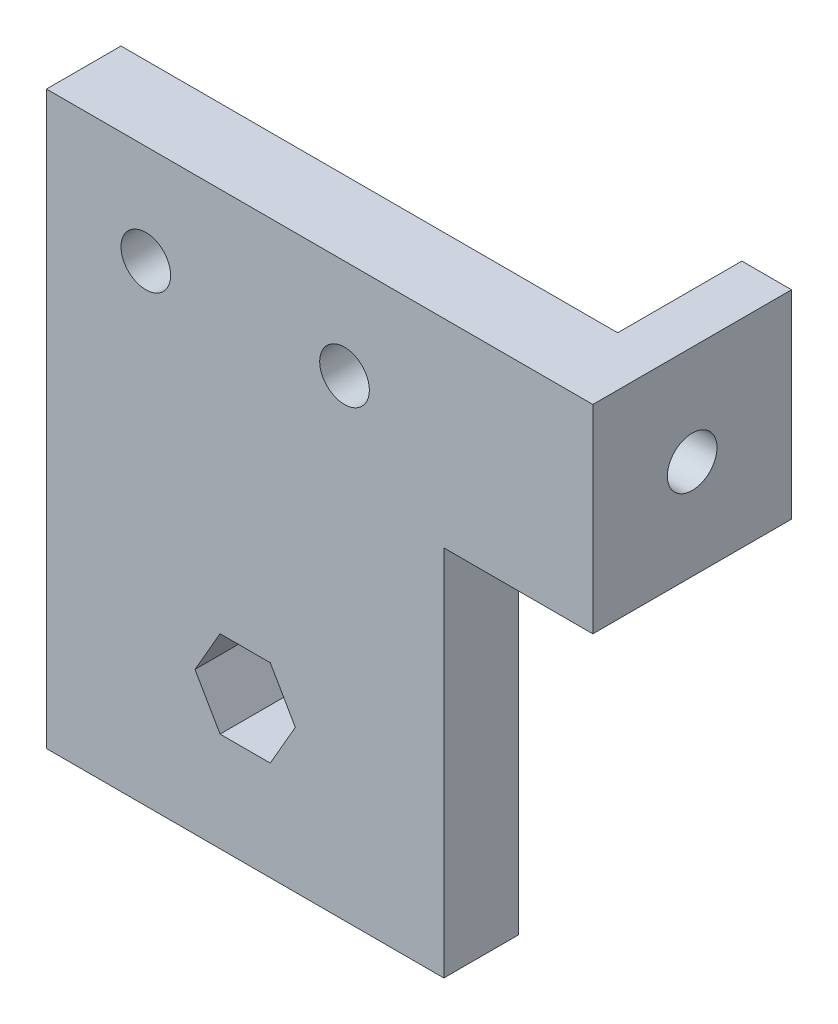
ISO-10303-21;
HEADER;
FILE_DESCRIPTION(('STEP AP214'),'2;1');
FILE_NAME('part.step','',(''),(''),'','','');
FILE_SCHEMA(('AUTOMOTIVE_DESIGN { 1 0 10303 214 1 1 1 1 }'));
ENDSEC;
DATA;
#1=APPLICATION_CONTEXT('core data for automotive mechanical design processes');
#2=APPLICATION_PROTOCOL_DEFINITION('international standard','automotive_design',2000,#1);
#3=PRODUCT_CONTEXT('',#1,'mechanical');
#4=PRODUCT('Part','Part','',(#3));
#5=PRODUCT_RELATED_PRODUCT_CATEGORY('part','',(#4));
#6=PRODUCT_DEFINITION_FORMATION('','',#4);
#7=PRODUCT_DEFINITION_CONTEXT('part definition',#1,'design');
#8=PRODUCT_DEFINITION('design','',#6,#7);
#9=PRODUCT_DEFINITION_SHAPE('','',#8);
#10=(LENGTH_UNIT() NAMED_UNIT(*) SI_UNIT(.MILLI.,.METRE.));
#11=(NAMED_UNIT(*) PLANE_ANGLE_UNIT() SI_UNIT($,.RADIAN.));
#12=(NAMED_UNIT(*) SI_UNIT($,.STERADIAN.) SOLID_ANGLE_UNIT());
#13=UNCERTAINTY_MEASURE_WITH_UNIT(LENGTH_MEASURE(1.E-05),#10,'distance_accuracy_value','');
#14=(GEOMETRIC_REPRESENTATION_CONTEXT(3) GLOBAL_UNCERTAINTY_ASSIGNED_CONTEXT((#13)) GLOBAL_UNIT_ASSIGNED_CONTEXT((#10,
#11,#12)) REPRESENTATION_CONTEXT('',''));
#15=CARTESIAN_POINT('',(0.,0.,0.));
#16=DIRECTION('',(0.,0.,1.));
#17=DIRECTION('',(1.,0.,0.));
#18=AXIS2_PLACEMENT_3D('',#15,#16,#17);
#19=CARTESIAN_POINT('',(0.,73.025,0.));
#20=DIRECTION('',(0.,0.,-1.));
#21=DIRECTION('',(-1.,0.,0.));
#22=AXIS2_PLACEMENT_3D('',#19,#20,#21);
#23=PLANE('',#22);
#24=DIRECTION('',(1.,0.,0.));
#25=VECTOR('',#24,1.);
#26=CARTESIAN_POINT('',(22.1920975668151,12.7,0.));
#27=LINE('',#26,#25);
#28=CARTESIAN_POINT('',(22.1920975668151,12.7,0.));
#29=VERTEX_POINT('',#28);
#30=CARTESIAN_POINT('',(28.6079024331849,12.7,0.));
#31=VERTEX_POINT('',#30);
#32=EDGE_CURVE('E250',#29,#31,#27,.T.);
#33=ORIENTED_EDGE('',*,*,#32,.T.);
#34=DIRECTION('',(0.5,0.866025403784439,0.));
#35=VECTOR('',#34,1.);
#36=CARTESIAN_POINT('',(28.6079024331849,12.7,0.));
#37=LINE('',#36,#35);
#38=CARTESIAN_POINT('',(31.8158048663697,18.25625,0.));
#39=VERTEX_POINT('',#38);
#40=EDGE_CURVE('E266',#31,#39,#37,.T.);
#41=ORIENTED_EDGE('',*,*,#40,.T.);
#42=DIRECTION('',(-0.5,0.866025403784439,0.));
#43=VECTOR('',#42,1.);
#44=CARTESIAN_POINT('',(31.8158048663697,18.25625,0.));
#45=LINE('',#44,#43);
#46=CARTESIAN_POINT('',(28.6079024331849,23.8125,0.));
#47=VERTEX_POINT('',#46);
#48=EDGE_CURVE('E263',#39,#47,#45,.T.);
#49=ORIENTED_EDGE('',*,*,#48,.T.);
#50=DIRECTION('',(-1.,0.,0.));
#51=VECTOR('',#50,1.);
#52=CARTESIAN_POINT('',(28.6079024331849,23.8125,0.));
#53=LINE('',#52,#51);
#54=CARTESIAN_POINT('',(22.1920975668151,23.8125,0.));
#55=VERTEX_POINT('',#54);
#56=EDGE_CURVE('E260',#47,#55,#53,.T.);
#57=ORIENTED_EDGE('',*,*,#56,.T.);
#58=DIRECTION('',(-0.5,-0.866025403784439,0.));
#59=VECTOR('',#58,1.);
#60=CARTESIAN_POINT('',(22.1920975668151,23.8125,0.));
#61=LINE('',#60,#59);
#62=CARTESIAN_POINT('',(18.9841951336303,18.25625,0.));
#63=VERTEX_POINT('',#62);
#64=EDGE_CURVE('E257',#55,#63,#61,.T.);
#65=ORIENTED_EDGE('',*,*,#64,.T.);
#66=DIRECTION('',(0.5,-0.866025403784439,0.));
#67=VECTOR('',#66,1.);
#68=CARTESIAN_POINT('',(18.9841951336303,18.25625,0.));
#69=LINE('',#68,#67);
#70=EDGE_CURVE('E254',#63,#29,#69,.T.);
#71=ORIENTED_EDGE('',*,*,#70,.T.);
#72=EDGE_LOOP('',(#33,#41,#49,#57,#65,#71));
#73=FACE_BOUND('',#72,.T.);
#74=CARTESIAN_POINT('',(12.7,60.325,0.));
#75=DIRECTION('',(0.,0.,1.));
#76=DIRECTION('',(1.,0.,0.));
#77=AXIS2_PLACEMENT_3D('',#74,#75,#76);
#78=CIRCLE('',#77,3.175);
#79=CARTESIAN_POINT('',(15.875,60.325,0.));
#80=VERTEX_POINT('',#79);
#81=EDGE_CURVE('E224',#80,#80,#78,.T.);
#82=ORIENTED_EDGE('',*,*,#81,.T.);
#83=EDGE_LOOP('',(#82));
#84=FACE_BOUND('',#83,.T.);
#85=CARTESIAN_POINT('',(38.1,60.325,0.));
#86=DIRECTION('',(0.,0.,1.));
#87=DIRECTION('',(-1.,0.,0.));
#88=AXIS2_PLACEMENT_3D('',#85,#86,#87);
#89=CIRCLE('',#88,3.175);
#90=CARTESIAN_POINT('',(34.925,60.325,0.));
#91=VERTEX_POINT('',#90);
#92=EDGE_CURVE('E230',#91,#91,#89,.T.);
#93=ORIENTED_EDGE('',*,*,#92,.T.);
#94=EDGE_LOOP('',(#93));
#95=FACE_BOUND('',#94,.T.);
#96=DIRECTION('',(1.,0.,0.));
#97=VECTOR('',#96,1.);
#98=CARTESIAN_POINT('',(50.8,64.452011509555,0.));
#99=LINE('',#98,#97);
#100=CARTESIAN_POINT('',(63.5,64.452011509555,0.));
#101=VERTEX_POINT('',#100);
#102=CARTESIAN_POINT('',(48.8,64.452011509555,0.));
#103=VERTEX_POINT('',#102);
#104=EDGE_CURVE('E52',#101,#103,#99,.F.);
#105=ORIENTED_EDGE('',*,*,#104,.T.);
#106=DIRECTION('',(0.,1.,0.));
#107=VECTOR('',#106,1.);
#108=CARTESIAN_POINT('',(48.8,56.1979884904449,0.));
#109=LINE('',#108,#107);
#110=CARTESIAN_POINT('',(48.8,56.1979884904449,0.));
#111=VERTEX_POINT('',#110);
#112=EDGE_CURVE('E164',#103,#111,#109,.F.);
#113=ORIENTED_EDGE('',*,*,#112,.T.);
#114=DIRECTION('',(1.,0.,0.));
#115=VECTOR('',#114,1.);
#116=CARTESIAN_POINT('',(50.8,56.1979884904449,0.));
#117=LINE('',#116,#115);
#118=CARTESIAN_POINT('',(63.5,56.1979884904449,0.));
#119=VERTEX_POINT('',#118);
#120=EDGE_CURVE('E59',#111,#119,#117,.T.);
#121=ORIENTED_EDGE('',*,*,#120,.T.);
#122=DIRECTION('',(0.,1.,0.));
#123=VECTOR('',#122,1.);
#124=CARTESIAN_POINT('',(63.5,73.025,0.));
#125=LINE('',#124,#123);
#126=CARTESIAN_POINT('',(63.5,47.625,0.));
#127=VERTEX_POINT('',#126);
#128=EDGE_CURVE('E161',#127,#119,#125,.T.);
#129=ORIENTED_EDGE('',*,*,#128,.F.);
#130=DIRECTION('',(1.,0.,0.));
#131=VECTOR('',#130,1.);
#132=CARTESIAN_POINT('',(50.8,47.625,0.));
#133=LINE('',#132,#131);
#134=CARTESIAN_POINT('',(50.8,47.625,0.));
#135=VERTEX_POINT('',#134);
#136=EDGE_CURVE('E175',#135,#127,#133,.T.);
#137=ORIENTED_EDGE('',*,*,#136,.F.);
#138=DIRECTION('',(0.,1.,0.));
#139=VECTOR('',#138,1.);
#140=CARTESIAN_POINT('',(50.8,0.,0.));
#141=LINE('',#140,#139);
#142=CARTESIAN_POINT('',(50.8,0.,0.));
#143=VERTEX_POINT('',#142);
#144=EDGE_CURVE('E185',#143,#135,#141,.T.);
#145=ORIENTED_EDGE('',*,*,#144,.F.);
#146=DIRECTION('',(1.,0.,0.));
#147=VECTOR('',#146,1.);
#148=CARTESIAN_POINT('',(0.,0.,0.));
#149=LINE('',#148,#147);
#150=CARTESIAN_POINT('',(0.,0.,0.));
#151=VERTEX_POINT('',#150);
#152=EDGE_CURVE('E204',#151,#143,#149,.T.);
#153=ORIENTED_EDGE('',*,*,#152,.F.);
#154=DIRECTION('',(0.,-1.,0.));
#155=VECTOR('',#154,1.);
#156=CARTESIAN_POINT('',(0.,0.,0.));
#157=LINE('',#156,#155);
#158=CARTESIAN_POINT('',(0.,73.025,0.));
#159=VERTEX_POINT('',#158);
#160=EDGE_CURVE('E208',#159,#151,#157,.T.);
#161=ORIENTED_EDGE('',*,*,#160,.F.);
#162=DIRECTION('',(-1.,0.,0.));
#163=VECTOR('',#162,1.);
#164=CARTESIAN_POINT('',(0.,73.025,0.));
#165=LINE('',#164,#163);
#166=CARTESIAN_POINT('',(63.5,73.025,0.));
#167=VERTEX_POINT('',#166);
#168=EDGE_CURVE('E170',#167,#159,#165,.T.);
#169=ORIENTED_EDGE('',*,*,#168,.F.);
#170=EDGE_CURVE('E171',#101,#167,#125,.T.);
#171=ORIENTED_EDGE('',*,*,#170,.F.);
#172=EDGE_LOOP('',(#105,#113,#121,#129,#137,#145,#153,#161,#169,#171));
#173=FACE_BOUND('',#172,.T.);
#174=ADVANCED_FACE('F32',(#73,#84,#95,#173),#23,.T.);
#175=CARTESIAN_POINT('',(0.,73.025,9.525));
#176=DIRECTION('',(0.,0.,-1.));
#177=DIRECTION('',(-1.,0.,0.));
#178=AXIS2_PLACEMENT_3D('',#175,#176,#177);
#179=PLANE('',#178);
#180=CARTESIAN_POINT('',(38.1,60.325,9.525));
#181=DIRECTION('',(0.,0.,1.));
#182=DIRECTION('',(-1.,0.,0.));
#183=AXIS2_PLACEMENT_3D('',#180,#181,#182);
#184=CIRCLE('',#183,3.175);
#185=CARTESIAN_POINT('',(34.925,60.325,9.525));
#186=VERTEX_POINT('',#185);
#187=EDGE_CURVE('E227',#186,#186,#184,.T.);
#188=ORIENTED_EDGE('',*,*,#187,.F.);
#189=EDGE_LOOP('',(#188));
#190=FACE_BOUND('',#189,.T.);
#191=DIRECTION('',(0.,-1.,0.));
#192=VECTOR('',#191,1.);
#193=CARTESIAN_POINT('',(0.,0.,9.525));
#194=LINE('',#193,#192);
#195=CARTESIAN_POINT('',(0.,73.025,9.525));
#196=VERTEX_POINT('',#195);
#197=CARTESIAN_POINT('',(0.,0.,9.525));
#198=VERTEX_POINT('',#197);
#199=EDGE_CURVE('E173',#196,#198,#194,.T.);
#200=ORIENTED_EDGE('',*,*,#199,.T.);
#201=DIRECTION('',(1.,0.,0.));
#202=VECTOR('',#201,1.);
#203=CARTESIAN_POINT('',(0.,0.,9.525));
#204=LINE('',#203,#202);
#205=CARTESIAN_POINT('',(50.8,0.,9.525));
#206=VERTEX_POINT('',#205);
#207=EDGE_CURVE('E220',#198,#206,#204,.T.);
#208=ORIENTED_EDGE('',*,*,#207,.T.);
#209=DIRECTION('',(0.,1.,0.));
#210=VECTOR('',#209,1.);
#211=CARTESIAN_POINT('',(50.8,0.,9.525));
#212=LINE('',#211,#210);
#213=CARTESIAN_POINT('',(50.8,47.625,9.525));
#214=VERTEX_POINT('',#213);
#215=EDGE_CURVE('E218',#206,#214,#212,.T.);
#216=ORIENTED_EDGE('',*,*,#215,.T.);
#217=DIRECTION('',(1.,0.,0.));
#218=VECTOR('',#217,1.);
#219=CARTESIAN_POINT('',(50.8,47.625,9.525));
#220=LINE('',#219,#218);
#221=CARTESIAN_POINT('',(69.85,47.625,9.525));
#222=VERTEX_POINT('',#221);
#223=EDGE_CURVE('E216',#214,#222,#220,.T.);
#224=ORIENTED_EDGE('',*,*,#223,.T.);
#225=DIRECTION('',(0.,-1.,0.));
#226=VECTOR('',#225,1.);
#227=CARTESIAN_POINT('',(69.85,73.025,9.525));
#228=LINE('',#227,#226);
#229=CARTESIAN_POINT('',(69.85,73.025,9.525));
#230=VERTEX_POINT('',#229);
#231=EDGE_CURVE('E309',#230,#222,#228,.T.);
#232=ORIENTED_EDGE('',*,*,#231,.F.);
#233=DIRECTION('',(-1.,0.,0.));
#234=VECTOR('',#233,1.);
#235=CARTESIAN_POINT('',(50.8,73.025,9.525));
#236=LINE('',#235,#234);
#237=EDGE_CURVE('E192',#230,#196,#236,.T.);
#238=ORIENTED_EDGE('',*,*,#237,.T.);
#239=EDGE_LOOP('',(#200,#208,#216,#224,#232,#238));
#240=FACE_BOUND('',#239,.T.);
#241=CARTESIAN_POINT('',(12.7,60.325,9.525));
#242=DIRECTION('',(0.,0.,1.));
#243=DIRECTION('',(1.,0.,0.));
#244=AXIS2_PLACEMENT_3D('',#241,#242,#243);
#245=CIRCLE('',#244,3.175);
#246=CARTESIAN_POINT('',(15.875,60.325,9.525));
#247=VERTEX_POINT('',#246);
#248=EDGE_CURVE('E212',#247,#247,#245,.T.);
#249=ORIENTED_EDGE('',*,*,#248,.F.);
#250=EDGE_LOOP('',(#249));
#251=FACE_BOUND('',#250,.T.);
#252=DIRECTION('',(0.5,0.866025403784439,0.));
#253=VECTOR('',#252,1.);
#254=CARTESIAN_POINT('',(28.6079024331849,12.7,9.525));
#255=LINE('',#254,#253);
#256=CARTESIAN_POINT('',(28.6079024331849,12.7,9.525));
#257=VERTEX_POINT('',#256);
#258=CARTESIAN_POINT('',(31.8158048663697,18.25625,9.525));
#259=VERTEX_POINT('',#258);
#260=EDGE_CURVE('E253',#257,#259,#255,.T.);
#261=ORIENTED_EDGE('',*,*,#260,.F.);
#262=DIRECTION('',(1.,0.,0.));
#263=VECTOR('',#262,1.);
#264=CARTESIAN_POINT('',(22.1920975668151,12.7,9.525));
#265=LINE('',#264,#263);
#266=CARTESIAN_POINT('',(22.1920975668151,12.7,9.525));
#267=VERTEX_POINT('',#266);
#268=EDGE_CURVE('E249',#267,#257,#265,.T.);
#269=ORIENTED_EDGE('',*,*,#268,.F.);
#270=DIRECTION('',(0.5,-0.866025403784439,0.));
#271=VECTOR('',#270,1.);
#272=CARTESIAN_POINT('',(18.9841951336303,18.25625,9.525));
#273=LINE('',#272,#271);
#274=CARTESIAN_POINT('',(18.9841951336303,18.25625,9.525));
#275=VERTEX_POINT('',#274);
#276=EDGE_CURVE('E271',#275,#267,#273,.T.);
#277=ORIENTED_EDGE('',*,*,#276,.F.);
#278=DIRECTION('',(-0.5,-0.866025403784439,0.));
#279=VECTOR('',#278,1.);
#280=CARTESIAN_POINT('',(22.1920975668151,23.8125,9.525));
#281=LINE('',#280,#279);
#282=CARTESIAN_POINT('',(22.1920975668151,23.8125,9.525));
#283=VERTEX_POINT('',#282);
#284=EDGE_CURVE('E274',#283,#275,#281,.T.);
#285=ORIENTED_EDGE('',*,*,#284,.F.);
#286=DIRECTION('',(-1.,0.,0.));
#287=VECTOR('',#286,1.);
#288=CARTESIAN_POINT('',(28.6079024331849,23.8125,9.525));
#289=LINE('',#288,#287);
#290=CARTESIAN_POINT('',(28.6079024331849,23.8125,9.525));
#291=VERTEX_POINT('',#290);
#292=EDGE_CURVE('E276',#291,#283,#289,.T.);
#293=ORIENTED_EDGE('',*,*,#292,.F.);
#294=DIRECTION('',(-0.5,0.866025403784439,0.));
#295=VECTOR('',#294,1.);
#296=CARTESIAN_POINT('',(31.8158048663697,18.25625,9.525));
#297=LINE('',#296,#295);
#298=EDGE_CURVE('E278',#259,#291,#297,.T.);
#299=ORIENTED_EDGE('',*,*,#298,.F.);
#300=EDGE_LOOP('',(#261,#269,#277,#285,#293,#299));
#301=FACE_BOUND('',#300,.T.);
#302=ADVANCED_FACE('F324',(#190,#240,#251,#301),#179,.F.);
#303=CARTESIAN_POINT('',(0.,0.,9.525));
#304=DIRECTION('',(1.,0.,0.));
#305=DIRECTION('',(0.,1.,0.));
#306=AXIS2_PLACEMENT_3D('',#303,#304,#305);
#307=PLANE('',#306);
#308=ORIENTED_EDGE('',*,*,#160,.T.);
#309=DIRECTION('',(0.,0.,-1.));
#310=VECTOR('',#309,1.);
#311=CARTESIAN_POINT('',(0.,0.,9.525));
#312=LINE('',#311,#310);
#313=EDGE_CURVE('E198',#198,#151,#312,.T.);
#314=ORIENTED_EDGE('',*,*,#313,.F.);
#315=ORIENTED_EDGE('',*,*,#199,.F.);
#316=DIRECTION('',(0.,0.,-1.));
#317=VECTOR('',#316,1.);
#318=CARTESIAN_POINT('',(0.,73.025,9.525));
#319=LINE('',#318,#317);
#320=EDGE_CURVE('E187',#196,#159,#319,.T.);
#321=ORIENTED_EDGE('',*,*,#320,.T.);
#322=EDGE_LOOP('',(#308,#314,#315,#321));
#323=FACE_BOUND('',#322,.T.);
#324=ADVANCED_FACE('F348',(#323),#307,.F.);
#325=CARTESIAN_POINT('',(0.,0.,9.525));
#326=DIRECTION('',(0.,1.,0.));
#327=DIRECTION('',(0.,0.,1.));
#328=AXIS2_PLACEMENT_3D('',#325,#326,#327);
#329=PLANE('',#328);
#330=ORIENTED_EDGE('',*,*,#152,.T.);
#331=DIRECTION('',(0.,0.,-1.));
#332=VECTOR('',#331,1.);
#333=CARTESIAN_POINT('',(50.8,0.,9.525));
#334=LINE('',#333,#332);
#335=EDGE_CURVE('E195',#206,#143,#334,.T.);
#336=ORIENTED_EDGE('',*,*,#335,.F.);
#337=ORIENTED_EDGE('',*,*,#207,.F.);
#338=ORIENTED_EDGE('',*,*,#313,.T.);
#339=EDGE_LOOP('',(#330,#336,#337,#338));
#340=FACE_BOUND('',#339,.T.);
#341=ADVANCED_FACE('F340',(#340),#329,.F.);
#342=CARTESIAN_POINT('',(50.8,0.,9.525));
#343=DIRECTION('',(-1.,0.,0.));
#344=DIRECTION('',(0.,-1.,0.));
#345=AXIS2_PLACEMENT_3D('',#342,#343,#344);
#346=PLANE('',#345);
#347=ORIENTED_EDGE('',*,*,#144,.T.);
#348=DIRECTION('',(0.,0.,-1.));
#349=VECTOR('',#348,1.);
#350=CARTESIAN_POINT('',(50.8,47.625,9.525));
#351=LINE('',#350,#349);
#352=EDGE_CURVE('E191',#214,#135,#351,.T.);
#353=ORIENTED_EDGE('',*,*,#352,.F.);
#354=ORIENTED_EDGE('',*,*,#215,.F.);
#355=ORIENTED_EDGE('',*,*,#335,.T.);
#356=EDGE_LOOP('',(#347,#353,#354,#355));
#357=FACE_BOUND('',#356,.T.);
#358=ADVANCED_FACE('F332',(#357),#346,.F.);
#359=CARTESIAN_POINT('',(50.8,47.625,9.525));
#360=DIRECTION('',(0.,1.,0.));
#361=DIRECTION('',(0.,0.,1.));
#362=AXIS2_PLACEMENT_3D('',#359,#360,#361);
#363=PLANE('',#362);
#364=ORIENTED_EDGE('',*,*,#136,.T.);
#365=DIRECTION('',(0.,0.,-1.));
#366=VECTOR('',#365,1.);
#367=CARTESIAN_POINT('',(63.5,47.625,9.525));
#368=LINE('',#367,#366);
#369=CARTESIAN_POINT('',(63.5,47.625,-15.875));
#370=VERTEX_POINT('',#369);
#371=EDGE_CURVE('E169',#127,#370,#368,.T.);
#372=ORIENTED_EDGE('',*,*,#371,.T.);
#373=DIRECTION('',(-1.,0.,0.));
#374=VECTOR('',#373,1.);
#375=CARTESIAN_POINT('',(69.85,47.625,-15.875));
#376=LINE('',#375,#374);
#377=CARTESIAN_POINT('',(69.85,47.625,-15.875));
#378=VERTEX_POINT('',#377);
#379=EDGE_CURVE('E269',#378,#370,#376,.T.);
#380=ORIENTED_EDGE('',*,*,#379,.F.);
#381=DIRECTION('',(0.,0.,-1.));
#382=VECTOR('',#381,1.);
#383=CARTESIAN_POINT('',(69.85,47.625,9.525));
#384=LINE('',#383,#382);
#385=EDGE_CURVE('E311',#222,#378,#384,.T.);
#386=ORIENTED_EDGE('',*,*,#385,.F.);
#387=ORIENTED_EDGE('',*,*,#223,.F.);
#388=ORIENTED_EDGE('',*,*,#352,.T.);
#389=EDGE_LOOP('',(#364,#372,#380,#386,#387,#388));
#390=FACE_BOUND('',#389,.T.);
#391=ADVANCED_FACE('F329',(#390),#363,.F.);
#392=CARTESIAN_POINT('',(0.,73.025,9.525));
#393=DIRECTION('',(0.,-1.,0.));
#394=DIRECTION('',(0.,0.,-1.));
#395=AXIS2_PLACEMENT_3D('',#392,#393,#394);
#396=PLANE('',#395);
#397=ORIENTED_EDGE('',*,*,#168,.T.);
#398=ORIENTED_EDGE('',*,*,#320,.F.);
#399=ORIENTED_EDGE('',*,*,#237,.F.);
#400=DIRECTION('',(0.,0.,1.));
#401=VECTOR('',#400,1.);
#402=CARTESIAN_POINT('',(69.85,73.025,9.525));
#403=LINE('',#402,#401);
#404=CARTESIAN_POINT('',(69.85,73.025,-15.875));
#405=VERTEX_POINT('',#404);
#406=EDGE_CURVE('E291',#405,#230,#403,.T.);
#407=ORIENTED_EDGE('',*,*,#406,.F.);
#408=DIRECTION('',(-1.,0.,0.));
#409=VECTOR('',#408,1.);
#410=CARTESIAN_POINT('',(69.85,73.025,-15.875));
#411=LINE('',#410,#409);
#412=CARTESIAN_POINT('',(63.5,73.025,-15.875));
#413=VERTEX_POINT('',#412);
#414=EDGE_CURVE('E295',#405,#413,#411,.T.);
#415=ORIENTED_EDGE('',*,*,#414,.T.);
#416=DIRECTION('',(0.,0.,1.));
#417=VECTOR('',#416,1.);
#418=CARTESIAN_POINT('',(63.5,73.025,9.525));
#419=LINE('',#418,#417);
#420=EDGE_CURVE('E285',#413,#167,#419,.T.);
#421=ORIENTED_EDGE('',*,*,#420,.T.);
#422=EDGE_LOOP('',(#397,#398,#399,#407,#415,#421));
#423=FACE_BOUND('',#422,.T.);
#424=ADVANCED_FACE('F331',(#423),#396,.F.);
#425=CARTESIAN_POINT('',(12.7,60.325,9.525));
#426=DIRECTION('',(0.,0.,-1.));
#427=DIRECTION('',(-1.,0.,0.));
#428=AXIS2_PLACEMENT_3D('',#425,#426,#427);
#429=CYLINDRICAL_SURFACE('',#428,3.175);
#430=ORIENTED_EDGE('',*,*,#248,.T.);
#431=EDGE_LOOP('',(#430));
#432=FACE_BOUND('',#431,.T.);
#433=ORIENTED_EDGE('',*,*,#81,.F.);
#434=EDGE_LOOP('',(#433));
#435=FACE_BOUND('',#434,.T.);
#436=ADVANCED_FACE('F338',(#432,#435),#429,.F.);
#437=CARTESIAN_POINT('',(38.1,60.325,9.525));
#438=DIRECTION('',(0.,0.,-1.));
#439=DIRECTION('',(-1.,0.,0.));
#440=AXIS2_PLACEMENT_3D('',#437,#438,#439);
#441=CYLINDRICAL_SURFACE('',#440,3.175);
#442=ORIENTED_EDGE('',*,*,#187,.T.);
#443=EDGE_LOOP('',(#442));
#444=FACE_BOUND('',#443,.T.);
#445=ORIENTED_EDGE('',*,*,#92,.F.);
#446=EDGE_LOOP('',(#445));
#447=FACE_BOUND('',#446,.T.);
#448=ADVANCED_FACE('F355',(#444,#447),#441,.F.);
#449=CARTESIAN_POINT('',(28.6079024331849,12.7,9.525));
#450=DIRECTION('',(-0.866025403784439,0.5,0.));
#451=DIRECTION('',(-0.5,-0.866025403784439,0.));
#452=AXIS2_PLACEMENT_3D('',#449,#450,#451);
#453=PLANE('',#452);
#454=ORIENTED_EDGE('',*,*,#40,.F.);
#455=DIRECTION('',(0.,0.,-1.));
#456=VECTOR('',#455,1.);
#457=CARTESIAN_POINT('',(28.6079024331849,12.7,9.525));
#458=LINE('',#457,#456);
#459=EDGE_CURVE('E246',#257,#31,#458,.T.);
#460=ORIENTED_EDGE('',*,*,#459,.F.);
#461=ORIENTED_EDGE('',*,*,#260,.T.);
#462=DIRECTION('',(0.,0.,-1.));
#463=VECTOR('',#462,1.);
#464=CARTESIAN_POINT('',(31.8158048663697,18.25625,9.525));
#465=LINE('',#464,#463);
#466=EDGE_CURVE('E233',#259,#39,#465,.T.);
#467=ORIENTED_EDGE('',*,*,#466,.T.);
#468=EDGE_LOOP('',(#454,#460,#461,#467));
#469=FACE_BOUND('',#468,.T.);
#470=ADVANCED_FACE('F359',(#469),#453,.T.);
#471=CARTESIAN_POINT('',(31.8158048663697,18.25625,9.525));
#472=DIRECTION('',(-0.866025403784438,-0.5,0.));
#473=DIRECTION('',(0.5,-0.866025403784438,0.));
#474=AXIS2_PLACEMENT_3D('',#471,#472,#473);
#475=PLANE('',#474);
#476=ORIENTED_EDGE('',*,*,#48,.F.);
#477=ORIENTED_EDGE('',*,*,#466,.F.);
#478=ORIENTED_EDGE('',*,*,#298,.T.);
#479=DIRECTION('',(0.,0.,-1.));
#480=VECTOR('',#479,1.);
#481=CARTESIAN_POINT('',(28.6079024331849,23.8125,9.525));
#482=LINE('',#481,#480);
#483=EDGE_CURVE('E238',#291,#47,#482,.T.);
#484=ORIENTED_EDGE('',*,*,#483,.T.);
#485=EDGE_LOOP('',(#476,#477,#478,#484));
#486=FACE_BOUND('',#485,.T.);
#487=ADVANCED_FACE('F363',(#486),#475,.T.);
#488=CARTESIAN_POINT('',(28.6079024331849,23.8125,9.525));
#489=DIRECTION('',(0.,-1.,0.));
#490=DIRECTION('',(0.,0.,-1.));
#491=AXIS2_PLACEMENT_3D('',#488,#489,#490);
#492=PLANE('',#491);
#493=ORIENTED_EDGE('',*,*,#56,.F.);
#494=ORIENTED_EDGE('',*,*,#483,.F.);
#495=ORIENTED_EDGE('',*,*,#292,.T.);
#496=DIRECTION('',(0.,0.,-1.));
#497=VECTOR('',#496,1.);
#498=CARTESIAN_POINT('',(22.1920975668151,23.8125,9.525));
#499=LINE('',#498,#497);
#500=EDGE_CURVE('E240',#283,#55,#499,.T.);
#501=ORIENTED_EDGE('',*,*,#500,.T.);
#502=EDGE_LOOP('',(#493,#494,#495,#501));
#503=FACE_BOUND('',#502,.T.);
#504=ADVANCED_FACE('F367',(#503),#492,.T.);
#505=CARTESIAN_POINT('',(22.1920975668151,23.8125,9.525));
#506=DIRECTION('',(0.866025403784438,-0.5,0.));
#507=DIRECTION('',(0.5,0.866025403784438,0.));
#508=AXIS2_PLACEMENT_3D('',#505,#506,#507);
#509=PLANE('',#508);
#510=ORIENTED_EDGE('',*,*,#64,.F.);
#511=ORIENTED_EDGE('',*,*,#500,.F.);
#512=ORIENTED_EDGE('',*,*,#284,.T.);
#513=DIRECTION('',(0.,0.,-1.));
#514=VECTOR('',#513,1.);
#515=CARTESIAN_POINT('',(18.9841951336303,18.25625,9.525));
#516=LINE('',#515,#514);
#517=EDGE_CURVE('E242',#275,#63,#516,.T.);
#518=ORIENTED_EDGE('',*,*,#517,.T.);
#519=EDGE_LOOP('',(#510,#511,#512,#518));
#520=FACE_BOUND('',#519,.T.);
#521=ADVANCED_FACE('F371',(#520),#509,.T.);
#522=CARTESIAN_POINT('',(18.9841951336303,18.25625,9.525));
#523=DIRECTION('',(0.866025403784439,0.5,0.));
#524=DIRECTION('',(-0.5,0.866025403784439,0.));
#525=AXIS2_PLACEMENT_3D('',#522,#523,#524);
#526=PLANE('',#525);
#527=ORIENTED_EDGE('',*,*,#70,.F.);
#528=ORIENTED_EDGE('',*,*,#517,.F.);
#529=ORIENTED_EDGE('',*,*,#276,.T.);
#530=DIRECTION('',(0.,0.,-1.));
#531=VECTOR('',#530,1.);
#532=CARTESIAN_POINT('',(22.1920975668151,12.7,9.525));
#533=LINE('',#532,#531);
#534=EDGE_CURVE('E244',#267,#29,#533,.T.);
#535=ORIENTED_EDGE('',*,*,#534,.T.);
#536=EDGE_LOOP('',(#527,#528,#529,#535));
#537=FACE_BOUND('',#536,.T.);
#538=ADVANCED_FACE('F375',(#537),#526,.T.);
#539=CARTESIAN_POINT('',(22.1920975668151,12.7,9.525));
#540=DIRECTION('',(0.,1.,0.));
#541=DIRECTION('',(0.,0.,1.));
#542=AXIS2_PLACEMENT_3D('',#539,#540,#541);
#543=PLANE('',#542);
#544=ORIENTED_EDGE('',*,*,#32,.F.);
#545=ORIENTED_EDGE('',*,*,#534,.F.);
#546=ORIENTED_EDGE('',*,*,#268,.T.);
#547=ORIENTED_EDGE('',*,*,#459,.T.);
#548=EDGE_LOOP('',(#544,#545,#546,#547));
#549=FACE_BOUND('',#548,.T.);
#550=ADVANCED_FACE('F379',(#549),#543,.T.);
#551=CARTESIAN_POINT('',(63.5,47.625,9.525));
#552=DIRECTION('',(1.,0.,0.));
#553=DIRECTION('',(0.,0.,-1.));
#554=AXIS2_PLACEMENT_3D('',#551,#552,#553);
#555=PLANE('',#554);
#556=CARTESIAN_POINT('',(63.5,60.325,-3.175));
#557=DIRECTION('',(1.,0.,0.));
#558=DIRECTION('',(0.,0.,-1.));
#559=AXIS2_PLACEMENT_3D('',#556,#557,#558);
#560=CIRCLE('',#559,3.175);
#561=CARTESIAN_POINT('',(63.5,60.325,-6.35));
#562=VERTEX_POINT('',#561);
#563=EDGE_CURVE('E318',#562,#562,#560,.T.);
#564=ORIENTED_EDGE('',*,*,#563,.T.);
#565=EDGE_LOOP('',(#564));
#566=FACE_BOUND('',#565,.T.);
#567=ORIENTED_EDGE('',*,*,#128,.T.);
#568=CARTESIAN_POINT('',(63.5,60.325,-3.175));
#569=DIRECTION('',(-1.,0.,0.));
#570=DIRECTION('',(0.,0.,1.));
#571=AXIS2_PLACEMENT_3D('',#568,#569,#570);
#572=CIRCLE('',#571,5.207);
#573=EDGE_CURVE('E153',#119,#101,#572,.T.);
#574=ORIENTED_EDGE('',*,*,#573,.T.);
#575=ORIENTED_EDGE('',*,*,#170,.T.);
#576=ORIENTED_EDGE('',*,*,#420,.F.);
#577=DIRECTION('',(0.,1.,0.));
#578=VECTOR('',#577,1.);
#579=CARTESIAN_POINT('',(63.5,73.025,-15.875));
#580=LINE('',#579,#578);
#581=EDGE_CURVE('E283',#370,#413,#580,.T.);
#582=ORIENTED_EDGE('',*,*,#581,.F.);
#583=ORIENTED_EDGE('',*,*,#371,.F.);
#584=EDGE_LOOP('',(#567,#574,#575,#576,#582,#583));
#585=FACE_BOUND('',#584,.T.);
#586=ADVANCED_FACE('F167',(#566,#585),#555,.F.);
#587=CARTESIAN_POINT('',(69.85,47.625,9.525));
#588=DIRECTION('',(1.,0.,0.));
#589=DIRECTION('',(0.,0.,-1.));
#590=AXIS2_PLACEMENT_3D('',#587,#588,#589);
#591=PLANE('',#590);
#592=ORIENTED_EDGE('',*,*,#231,.T.);
#593=ORIENTED_EDGE('',*,*,#385,.T.);
#594=DIRECTION('',(0.,1.,0.));
#595=VECTOR('',#594,1.);
#596=CARTESIAN_POINT('',(69.85,73.025,-15.875));
#597=LINE('',#596,#595);
#598=EDGE_CURVE('E303',#378,#405,#597,.T.);
#599=ORIENTED_EDGE('',*,*,#598,.T.);
#600=ORIENTED_EDGE('',*,*,#406,.T.);
#601=EDGE_LOOP('',(#592,#593,#599,#600));
#602=FACE_BOUND('',#601,.T.);
#603=CARTESIAN_POINT('',(69.85,60.325,-3.175));
#604=DIRECTION('',(1.,0.,0.));
#605=DIRECTION('',(0.,0.,-1.));
#606=AXIS2_PLACEMENT_3D('',#603,#604,#605);
#607=CIRCLE('',#606,3.175);
#608=CARTESIAN_POINT('',(69.85,60.325,-6.35));
#609=VERTEX_POINT('',#608);
#610=EDGE_CURVE('E284',#609,#609,#607,.T.);
#611=ORIENTED_EDGE('',*,*,#610,.F.);
#612=EDGE_LOOP('',(#611));
#613=FACE_BOUND('',#612,.T.);
#614=ADVANCED_FACE('F321',(#602,#613),#591,.T.);
#615=CARTESIAN_POINT('',(69.85,73.025,-15.875));
#616=DIRECTION('',(0.,0.,1.));
#617=DIRECTION('',(0.,-1.,0.));
#618=AXIS2_PLACEMENT_3D('',#615,#616,#617);
#619=PLANE('',#618);
#620=ORIENTED_EDGE('',*,*,#581,.T.);
#621=ORIENTED_EDGE('',*,*,#414,.F.);
#622=ORIENTED_EDGE('',*,*,#598,.F.);
#623=ORIENTED_EDGE('',*,*,#379,.T.);
#624=EDGE_LOOP('',(#620,#621,#622,#623));
#625=FACE_BOUND('',#624,.T.);
#626=ADVANCED_FACE('F301',(#625),#619,.F.);
#627=CARTESIAN_POINT('',(69.85,60.325,-3.175));
#628=DIRECTION('',(-1.,0.,0.));
#629=DIRECTION('',(0.,0.,1.));
#630=AXIS2_PLACEMENT_3D('',#627,#628,#629);
#631=CYLINDRICAL_SURFACE('',#630,3.175);
#632=ORIENTED_EDGE('',*,*,#610,.T.);
#633=EDGE_LOOP('',(#632));
#634=FACE_BOUND('',#633,.T.);
#635=ORIENTED_EDGE('',*,*,#563,.F.);
#636=EDGE_LOOP('',(#635));
#637=FACE_BOUND('',#636,.T.);
#638=ADVANCED_FACE('F386',(#634,#637),#631,.F.);
#639=CARTESIAN_POINT('',(50.8,60.325,-3.175));
#640=DIRECTION('',(1.,0.,0.));
#641=DIRECTION('',(0.,0.,-1.));
#642=AXIS2_PLACEMENT_3D('',#639,#640,#641);
#643=CYLINDRICAL_SURFACE('',#642,5.207);
#644=ORIENTED_EDGE('',*,*,#573,.F.);
#645=ORIENTED_EDGE('',*,*,#120,.F.);
#646=CARTESIAN_POINT('',(48.8,56.1979884904449,0.));
#647=CARTESIAN_POINT('',(48.8462198371007,56.1979879585688,-8.72535171692026E-06));
#648=CARTESIAN_POINT('',(48.8924362531844,56.1992211034572,0.00160200254746283));
#649=CARTESIAN_POINT('',(48.9845071472262,56.2041492760781,0.0079967197583316));
#650=CARTESIAN_POINT('',(49.0303617018729,56.2078437671876,0.0127800173849919));
#651=CARTESIAN_POINT('',(49.1212141428741,56.2176718486777,0.0254319891543066));
#652=CARTESIAN_POINT('',(49.1662144753703,56.2237968130747,0.0332897503650759));
#653=CARTESIAN_POINT('',(49.2551844908465,56.238467669281,0.0519556291753077));
#654=CARTESIAN_POINT('',(49.2991541586465,56.2470135967229,0.0627637901996101));
#655=CARTESIAN_POINT('',(49.4290296457978,56.2762574815332,0.0993731779084116));
#656=CARTESIAN_POINT('',(49.5130056890655,56.3005726614793,0.12937422223261));
#657=CARTESIAN_POINT('',(49.6734992441099,56.3585166435016,0.198705011618891));
#658=CARTESIAN_POINT('',(49.7500140488572,56.3921488090227,0.238038124833378));
#659=CARTESIAN_POINT('',(49.8962678557608,56.4693108704502,0.324995762388742));
#660=CARTESIAN_POINT('',(49.9657465277311,56.5130991492761,0.372827381219694));
#661=CARTESIAN_POINT('',(50.0945690353705,56.6091523109316,0.473310328655351));
#662=CARTESIAN_POINT('',(50.1539080040467,56.6614212410849,0.525963953272234));
#663=CARTESIAN_POINT('',(50.2852012138729,56.796940762279,0.656150532174284));
#664=CARTESIAN_POINT('',(50.352044950583,56.8840036328074,0.734875043470409));
#665=CARTESIAN_POINT('',(50.4674108424493,57.0703090795179,0.89128743722718));
#666=CARTESIAN_POINT('',(50.515901976552,57.1695719052954,0.968973352300986));
#667=CARTESIAN_POINT('',(50.5863565789723,57.3486105671557,1.09847529734508));
#668=CARTESIAN_POINT('',(50.6119474055865,57.4261550238004,1.15149026275141));
#669=CARTESIAN_POINT('',(50.6565174198239,57.5853822419069,1.25402993813837));
#670=CARTESIAN_POINT('',(50.6754935367576,57.6670669052412,1.30355301862446));
#671=CARTESIAN_POINT('',(50.708105276349,57.8341725112789,1.39861029491293));
#672=CARTESIAN_POINT('',(50.7217192457759,57.9196070852049,1.44412775267855));
#673=CARTESIAN_POINT('',(50.7446327968853,58.0933561706218,1.5305323610158));
#674=CARTESIAN_POINT('',(50.7539312383954,58.1816714366095,1.57141828577133));
#675=CARTESIAN_POINT('',(50.7716309380131,58.3889562894362,1.66039050433151));
#676=CARTESIAN_POINT('',(50.7788229014609,58.5088039288297,1.70667689333223));
#677=CARTESIAN_POINT('',(50.7894235733432,58.7517712361025,1.79031225570214));
#678=CARTESIAN_POINT('',(50.7928305459233,58.8748923787786,1.82765712219922));
#679=CARTESIAN_POINT('',(50.7973883491216,59.1222568676436,1.89278382792759));
#680=CARTESIAN_POINT('',(50.7985632732905,59.2464735168624,1.92066509179272));
#681=CARTESIAN_POINT('',(50.7995401354028,59.4340035169959,1.95559615851851));
#682=CARTESIAN_POINT('',(50.7997349030349,59.496692681164,1.96608896096369));
#683=CARTESIAN_POINT('',(50.799963268841,59.6224134148648,1.98477313183139));
#684=CARTESIAN_POINT('',(50.7999968669265,59.6854449845856,1.99296449898882));
#685=CARTESIAN_POINT('',(50.8,59.7486112423026,2.));
#686=B_SPLINE_CURVE_WITH_KNOTS('',3,(#646,#647,#648,#649,#650,#651,#652,#653,#654,#655,#656,
#657,#658,#659,#660,#661,#662,#663,#664,#665,#666,#667,#668,#669,#670,#671,#672,#673,#674,#675,
#676,#677,#678,#679,#680,#681,#682,#683,#684,#685),.UNSPECIFIED.,.F.,.F.,(4,2,2,2,2,2,2,2,2,2,2,
2,2,2,2,2,2,2,2,4),(0.,0.138609184602276,0.277188159499121,0.415279641212907,0.553373155506754,
0.829248100143064,1.10522276609302,1.38918796870013,1.67328909223872,2.07626533582923,
2.47991971233743,2.77161488056123,3.06344528013864,3.35644234435511,3.64951677506931,
4.03508495733091,4.42082989412015,4.80238676056272,4.99303466583295,5.18368267589989),.UNSPECIFIED.);
#687=CARTESIAN_POINT('',(50.8,59.7486112423026,2.));
#688=VERTEX_POINT('',#687);
#689=EDGE_CURVE('E11',#111,#688,#686,.T.);
#690=ORIENTED_EDGE('',*,*,#689,.T.);
#691=CARTESIAN_POINT('',(50.8,60.325,-3.175));
#692=DIRECTION('',(-1.,0.,0.));
#693=DIRECTION('',(0.,0.,1.));
#694=AXIS2_PLACEMENT_3D('',#691,#692,#693);
#695=CIRCLE('',#694,5.207);
#696=CARTESIAN_POINT('',(50.8,60.9013887576974,2.));
#697=VERTEX_POINT('',#696);
#698=EDGE_CURVE('E157',#688,#697,#695,.T.);
#699=ORIENTED_EDGE('',*,*,#698,.T.);
#700=CARTESIAN_POINT('',(50.8,60.9013887576974,2.));
#701=CARTESIAN_POINT('',(50.7999949066616,60.9727085547622,1.99205626088493));
#702=CARTESIAN_POINT('',(50.7999533063097,61.0438555215514,1.98263920376114));
#703=CARTESIAN_POINT('',(50.7996478149417,61.185702190071,1.96087299741853));
#704=CARTESIAN_POINT('',(50.7993839140504,61.2564018717909,1.9485237179585));
#705=CARTESIAN_POINT('',(50.7980335343093,61.4678696225066,1.90706110335046));
#706=CARTESIAN_POINT('',(50.7963875369251,61.6078016736585,1.87355580112293));
#707=CARTESIAN_POINT('',(50.7898300620135,61.8858593109648,1.79467712291249));
#708=CARTESIAN_POINT('',(50.7848828112227,62.0239480153046,1.74917707252011));
#709=CARTESIAN_POINT('',(50.7692690966823,62.2954836665564,1.64693329052572));
#710=CARTESIAN_POINT('',(50.7586082264586,62.4289350175199,1.59020058967152));
#711=CARTESIAN_POINT('',(50.7346452645892,62.6366920594268,1.49150512943281));
#712=CARTESIAN_POINT('',(50.7241864637011,62.7129536689642,1.45293524459271));
#713=CARTESIAN_POINT('',(50.6994353768735,62.8630217798551,1.37236648765509));
#714=CARTESIAN_POINT('',(50.6851431262125,62.9368283037954,1.33036764711614));
#715=CARTESIAN_POINT('',(50.6519779798158,63.0812658966549,1.24347461960126));
#716=CARTESIAN_POINT('',(50.6331233500617,63.1519083291194,1.19859248977021));
#717=CARTESIAN_POINT('',(50.5899569041538,63.2897858452237,1.10632949636663));
#718=CARTESIAN_POINT('',(50.5656466123193,63.3570218741978,1.05894933357146));
#719=CARTESIAN_POINT('',(50.4965500563094,63.5210621777964,0.937550511022426));
#720=CARTESIAN_POINT('',(50.4476581536432,63.6153332912425,0.86233932479641));
#721=CARTESIAN_POINT('',(50.3325053063295,63.7922670171011,0.711437181758008));
#722=CARTESIAN_POINT('',(50.2662614333809,63.8749409173226,0.635746767464299));
#723=CARTESIAN_POINT('',(50.1294907500129,64.0113367413767,0.503450773762212));
#724=CARTESIAN_POINT('',(50.0623002052343,64.0675625472812,0.445995620716338));
#725=CARTESIAN_POINT('',(49.9156752573647,64.169476095537,0.337603795813965));
#726=CARTESIAN_POINT('',(49.8362446825203,64.2151671216779,0.286665094928214));
#727=CARTESIAN_POINT('',(49.6658886261223,64.2952386162003,0.194544029371986));
#728=CARTESIAN_POINT('',(49.5748923877119,64.329544322427,0.153426631912359));
#729=CARTESIAN_POINT('',(49.3843932185633,64.3857594110301,0.0846134131717407));
#730=CARTESIAN_POINT('',(49.2848992102845,64.4076816159888,0.0569037130787657));
#731=CARTESIAN_POINT('',(49.1203937777861,64.4328460453872,0.0247951354078857));
#732=CARTESIAN_POINT('',(49.0568750912045,64.4400315356142,0.015527883774188));
#733=CARTESIAN_POINT('',(48.9289190958797,64.4496114919216,0.00312023191437653));
#734=CARTESIAN_POINT('',(48.8644822671382,64.4520083751424,-2.32593763369921E-05));
#735=CARTESIAN_POINT('',(48.8,64.452011509555,0.));
#736=B_SPLINE_CURVE_WITH_KNOTS('',3,(#700,#701,#702,#703,#704,#705,#706,#707,#708,#709,#710,
#711,#712,#713,#714,#715,#716,#717,#718,#719,#720,#721,#722,#723,#724,#725,#726,#727,#728,#729,
#730,#731,#732,#733,#734,#735),.UNSPECIFIED.,.F.,.F.,(4,2,2,2,2,2,2,2,2,2,2,2,2,2,2,2,2,4),(0.,
0.215249635568918,0.430508833721163,0.861643286972847,1.29752718139303,1.73298513108564,
1.99112126233882,2.24925501809004,2.50637192633146,2.76341708500025,3.15237356222724,
3.54094879346888,3.85398219858754,4.16691789594755,4.48186961430643,4.79649461310382,
4.98983208950827,5.18307195046026),.UNSPECIFIED.);
#737=EDGE_CURVE('E45',#697,#103,#736,.T.);
#738=ORIENTED_EDGE('',*,*,#737,.T.);
#739=ORIENTED_EDGE('',*,*,#104,.F.);
#740=EDGE_LOOP('',(#644,#645,#690,#699,#738,#739));
#741=FACE_BOUND('',#740,.T.);
#742=ADVANCED_FACE('F154',(#741),#643,.F.);
#743=CARTESIAN_POINT('',(50.8,60.325,-3.175));
#744=DIRECTION('',(-1.,0.,0.));
#745=DIRECTION('',(0.,0.,1.));
#746=AXIS2_PLACEMENT_3D('',#743,#744,#745);
#747=PLANE('',#746);
#748=ORIENTED_EDGE('',*,*,#698,.F.);
#749=DIRECTION('',(0.,1.,0.));
#750=VECTOR('',#749,1.);
#751=CARTESIAN_POINT('',(50.8,64.452011509555,2.));
#752=LINE('',#751,#750);
#753=EDGE_CURVE('E200',#688,#697,#752,.T.);
#754=ORIENTED_EDGE('',*,*,#753,.T.);
#755=EDGE_LOOP('',(#748,#754));
#756=FACE_BOUND('',#755,.T.);
#757=ADVANCED_FACE('F397',(#756),#747,.F.);
#758=CARTESIAN_POINT('',(48.8,60.325,2.));
#759=DIRECTION('',(0.,-1.,0.));
#760=DIRECTION('',(0.,0.,-1.));
#761=AXIS2_PLACEMENT_3D('',#758,#759,#760);
#762=CYLINDRICAL_SURFACE('',#761,2.);
#763=ORIENTED_EDGE('',*,*,#689,.F.);
#764=ORIENTED_EDGE('',*,*,#112,.F.);
#765=ORIENTED_EDGE('',*,*,#737,.F.);
#766=ORIENTED_EDGE('',*,*,#753,.F.);
#767=EDGE_LOOP('',(#763,#764,#765,#766));
#768=FACE_BOUND('',#767,.T.);
#769=ADVANCED_FACE('F34',(#768),#762,.T.);
#770=CLOSED_SHELL('',(#174,#302,#324,#341,#358,#391,#424,#436,#448,#470,#487,#504,#521,#538,
#550,#586,#614,#626,#638,#742,#757,#769));
#771=MANIFOLD_SOLID_BREP('B2',#770);
#772=ADVANCED_BREP_SHAPE_REPRESENTATION('',(#18,#771),#14);
#773=SHAPE_DEFINITION_REPRESENTATION(#9,#772);
ENDSEC;
END-ISO-10303-21;
